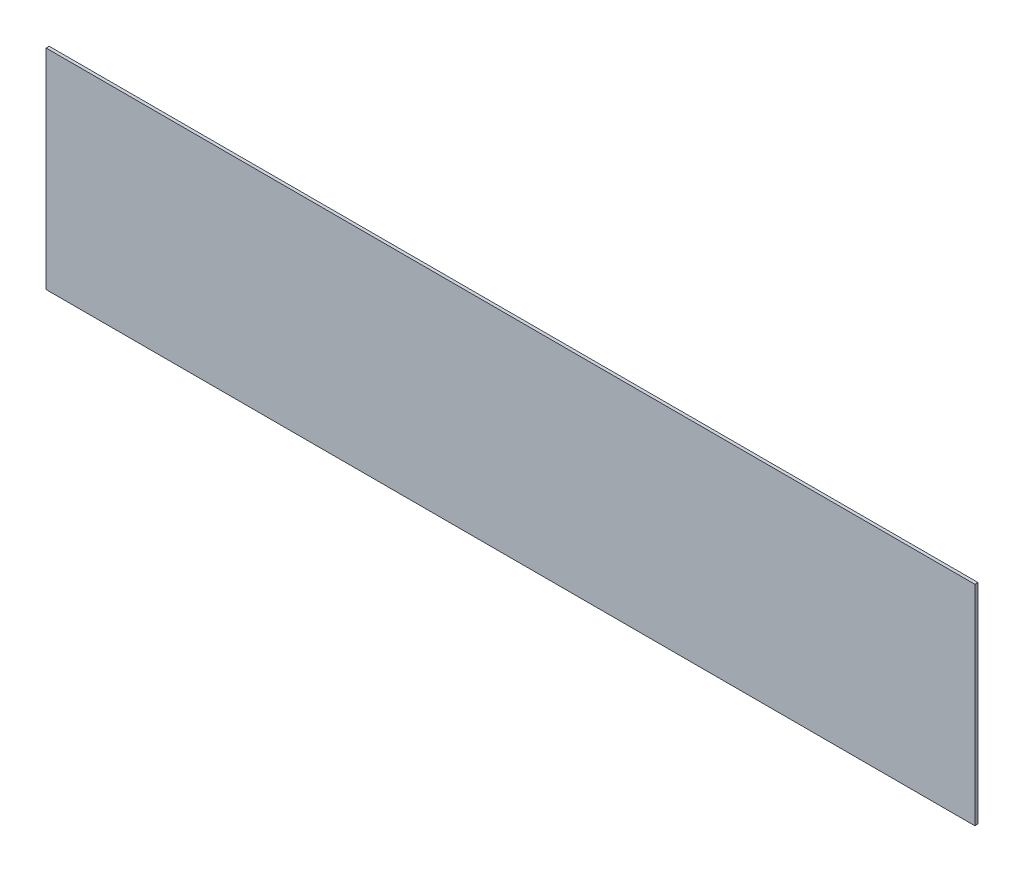
ISO-10303-21;
HEADER;
FILE_DESCRIPTION(('STEP AP214'),'2;1');
FILE_NAME('part.step','',(''),(''),'','','');
FILE_SCHEMA(('AUTOMOTIVE_DESIGN { 1 0 10303 214 1 1 1 1 }'));
ENDSEC;
DATA;
#1=APPLICATION_CONTEXT('core data for automotive mechanical design processes');
#2=APPLICATION_PROTOCOL_DEFINITION('international standard','automotive_design',2000,#1);
#3=PRODUCT_CONTEXT('',#1,'mechanical');
#4=PRODUCT('Part','Part','',(#3));
#5=PRODUCT_RELATED_PRODUCT_CATEGORY('part','',(#4));
#6=PRODUCT_DEFINITION_FORMATION('','',#4);
#7=PRODUCT_DEFINITION_CONTEXT('part definition',#1,'design');
#8=PRODUCT_DEFINITION('design','',#6,#7);
#9=PRODUCT_DEFINITION_SHAPE('','',#8);
#10=(LENGTH_UNIT() NAMED_UNIT(*) SI_UNIT(.MILLI.,.METRE.));
#11=(NAMED_UNIT(*) PLANE_ANGLE_UNIT() SI_UNIT($,.RADIAN.));
#12=(NAMED_UNIT(*) SI_UNIT($,.STERADIAN.) SOLID_ANGLE_UNIT());
#13=UNCERTAINTY_MEASURE_WITH_UNIT(LENGTH_MEASURE(1.E-05),#10,'distance_accuracy_value','');
#14=(GEOMETRIC_REPRESENTATION_CONTEXT(3) GLOBAL_UNCERTAINTY_ASSIGNED_CONTEXT((#13)) GLOBAL_UNIT_ASSIGNED_CONTEXT((#10,
#11,#12)) REPRESENTATION_CONTEXT('',''));
#15=CARTESIAN_POINT('',(0.,0.,0.));
#16=DIRECTION('',(0.,0.,1.));
#17=DIRECTION('',(1.,0.,0.));
#18=AXIS2_PLACEMENT_3D('',#15,#16,#17);
#19=CARTESIAN_POINT('',(599.5,-135.,4.));
#20=DIRECTION('',(-1.,0.,0.));
#21=DIRECTION('',(0.,0.,1.));
#22=AXIS2_PLACEMENT_3D('',#19,#20,#21);
#23=PLANE('',#22);
#24=DIRECTION('',(0.,1.,0.));
#25=VECTOR('',#24,1.);
#26=CARTESIAN_POINT('',(599.5,-135.,0.));
#27=LINE('',#26,#25);
#28=CARTESIAN_POINT('',(599.5,-135.,0.));
#29=VERTEX_POINT('',#28);
#30=CARTESIAN_POINT('',(599.5,135.,0.));
#31=VERTEX_POINT('',#30);
#32=EDGE_CURVE('E107',#29,#31,#27,.T.);
#33=ORIENTED_EDGE('',*,*,#32,.T.);
#34=DIRECTION('',(0.,0.,-1.));
#35=VECTOR('',#34,1.);
#36=CARTESIAN_POINT('',(599.5,135.,4.));
#37=LINE('',#36,#35);
#38=CARTESIAN_POINT('',(599.5,135.,4.));
#39=VERTEX_POINT('',#38);
#40=EDGE_CURVE('E11',#39,#31,#37,.T.);
#41=ORIENTED_EDGE('',*,*,#40,.F.);
#42=DIRECTION('',(0.,1.,0.));
#43=VECTOR('',#42,1.);
#44=CARTESIAN_POINT('',(599.5,-135.,4.));
#45=LINE('',#44,#43);
#46=CARTESIAN_POINT('',(599.5,-135.,4.));
#47=VERTEX_POINT('',#46);
#48=EDGE_CURVE('E91',#47,#39,#45,.T.);
#49=ORIENTED_EDGE('',*,*,#48,.F.);
#50=DIRECTION('',(0.,0.,-1.));
#51=VECTOR('',#50,1.);
#52=CARTESIAN_POINT('',(599.5,-135.,4.));
#53=LINE('',#52,#51);
#54=EDGE_CURVE('E103',#47,#29,#53,.T.);
#55=ORIENTED_EDGE('',*,*,#54,.T.);
#56=EDGE_LOOP('',(#33,#41,#49,#55));
#57=FACE_BOUND('',#56,.T.);
#58=ADVANCED_FACE('F39',(#57),#23,.F.);
#59=CARTESIAN_POINT('',(-599.5,135.,4.));
#60=DIRECTION('',(0.,-1.,0.));
#61=DIRECTION('',(0.,0.,-1.));
#62=AXIS2_PLACEMENT_3D('',#59,#60,#61);
#63=PLANE('',#62);
#64=DIRECTION('',(-1.,0.,0.));
#65=VECTOR('',#64,1.);
#66=CARTESIAN_POINT('',(-599.5,135.,0.));
#67=LINE('',#66,#65);
#68=CARTESIAN_POINT('',(-599.5,135.,0.));
#69=VERTEX_POINT('',#68);
#70=EDGE_CURVE('E96',#31,#69,#67,.T.);
#71=ORIENTED_EDGE('',*,*,#70,.T.);
#72=DIRECTION('',(0.,0.,-1.));
#73=VECTOR('',#72,1.);
#74=CARTESIAN_POINT('',(-599.5,135.,4.));
#75=LINE('',#74,#73);
#76=CARTESIAN_POINT('',(-599.5,135.,4.));
#77=VERTEX_POINT('',#76);
#78=EDGE_CURVE('E48',#77,#69,#75,.T.);
#79=ORIENTED_EDGE('',*,*,#78,.F.);
#80=DIRECTION('',(-1.,0.,0.));
#81=VECTOR('',#80,1.);
#82=CARTESIAN_POINT('',(-599.5,135.,4.));
#83=LINE('',#82,#81);
#84=EDGE_CURVE('E86',#39,#77,#83,.T.);
#85=ORIENTED_EDGE('',*,*,#84,.F.);
#86=ORIENTED_EDGE('',*,*,#40,.T.);
#87=EDGE_LOOP('',(#71,#79,#85,#86));
#88=FACE_BOUND('',#87,.T.);
#89=ADVANCED_FACE('F95',(#88),#63,.F.);
#90=CARTESIAN_POINT('',(-599.5,-135.,4.));
#91=DIRECTION('',(1.,0.,0.));
#92=DIRECTION('',(0.,0.,-1.));
#93=AXIS2_PLACEMENT_3D('',#90,#91,#92);
#94=PLANE('',#93);
#95=DIRECTION('',(0.,-1.,0.));
#96=VECTOR('',#95,1.);
#97=CARTESIAN_POINT('',(-599.5,-135.,0.));
#98=LINE('',#97,#96);
#99=CARTESIAN_POINT('',(-599.5,-135.,0.));
#100=VERTEX_POINT('',#99);
#101=EDGE_CURVE('E73',#69,#100,#98,.T.);
#102=ORIENTED_EDGE('',*,*,#101,.T.);
#103=DIRECTION('',(0.,0.,-1.));
#104=VECTOR('',#103,1.);
#105=CARTESIAN_POINT('',(-599.5,-135.,4.));
#106=LINE('',#105,#104);
#107=CARTESIAN_POINT('',(-599.5,-135.,4.));
#108=VERTEX_POINT('',#107);
#109=EDGE_CURVE('E98',#108,#100,#106,.T.);
#110=ORIENTED_EDGE('',*,*,#109,.F.);
#111=DIRECTION('',(0.,-1.,0.));
#112=VECTOR('',#111,1.);
#113=CARTESIAN_POINT('',(-599.5,-135.,4.));
#114=LINE('',#113,#112);
#115=EDGE_CURVE('E89',#77,#108,#114,.T.);
#116=ORIENTED_EDGE('',*,*,#115,.F.);
#117=ORIENTED_EDGE('',*,*,#78,.T.);
#118=EDGE_LOOP('',(#102,#110,#116,#117));
#119=FACE_BOUND('',#118,.T.);
#120=ADVANCED_FACE('F99',(#119),#94,.F.);
#121=CARTESIAN_POINT('',(-599.5,-135.,4.));
#122=DIRECTION('',(0.,1.,0.));
#123=DIRECTION('',(0.,0.,1.));
#124=AXIS2_PLACEMENT_3D('',#121,#122,#123);
#125=PLANE('',#124);
#126=DIRECTION('',(1.,0.,0.));
#127=VECTOR('',#126,1.);
#128=CARTESIAN_POINT('',(-599.5,-135.,0.));
#129=LINE('',#128,#127);
#130=EDGE_CURVE('E79',#100,#29,#129,.T.);
#131=ORIENTED_EDGE('',*,*,#130,.T.);
#132=ORIENTED_EDGE('',*,*,#54,.F.);
#133=DIRECTION('',(1.,0.,0.));
#134=VECTOR('',#133,1.);
#135=CARTESIAN_POINT('',(-599.5,-135.,4.));
#136=LINE('',#135,#134);
#137=EDGE_CURVE('E56',#108,#47,#136,.T.);
#138=ORIENTED_EDGE('',*,*,#137,.F.);
#139=ORIENTED_EDGE('',*,*,#109,.T.);
#140=EDGE_LOOP('',(#131,#132,#138,#139));
#141=FACE_BOUND('',#140,.T.);
#142=ADVANCED_FACE('F120',(#141),#125,.F.);
#143=CARTESIAN_POINT('',(0.,0.,4.));
#144=DIRECTION('',(0.,0.,-1.));
#145=DIRECTION('',(-1.,0.,0.));
#146=AXIS2_PLACEMENT_3D('',#143,#144,#145);
#147=PLANE('',#146);
#148=ORIENTED_EDGE('',*,*,#48,.T.);
#149=ORIENTED_EDGE('',*,*,#84,.T.);
#150=ORIENTED_EDGE('',*,*,#115,.T.);
#151=ORIENTED_EDGE('',*,*,#137,.T.);
#152=EDGE_LOOP('',(#148,#149,#150,#151));
#153=FACE_BOUND('',#152,.T.);
#154=ADVANCED_FACE('F87',(#153),#147,.F.);
#155=CARTESIAN_POINT('',(0.,0.,0.));
#156=DIRECTION('',(0.,0.,-1.));
#157=DIRECTION('',(-1.,0.,0.));
#158=AXIS2_PLACEMENT_3D('',#155,#156,#157);
#159=PLANE('',#158);
#160=ORIENTED_EDGE('',*,*,#32,.F.);
#161=ORIENTED_EDGE('',*,*,#130,.F.);
#162=ORIENTED_EDGE('',*,*,#101,.F.);
#163=ORIENTED_EDGE('',*,*,#70,.F.);
#164=EDGE_LOOP('',(#160,#161,#162,#163));
#165=FACE_BOUND('',#164,.T.);
#166=ADVANCED_FACE('F123',(#165),#159,.T.);
#167=CLOSED_SHELL('',(#58,#89,#120,#142,#154,#166));
#168=MANIFOLD_SOLID_BREP('B2',#167);
#169=ADVANCED_BREP_SHAPE_REPRESENTATION('',(#18,#168),#14);
#170=SHAPE_DEFINITION_REPRESENTATION(#9,#169);
ENDSEC;
END-ISO-10303-21;
